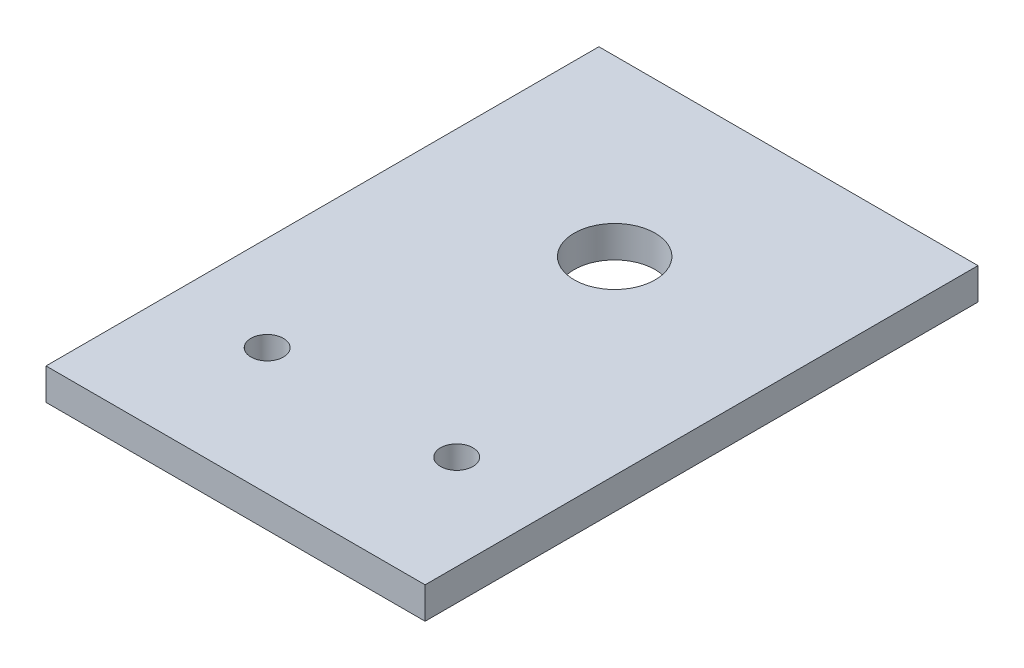
ISO-10303-21;
HEADER;
FILE_DESCRIPTION(('STEP AP214'),'2;1');
FILE_NAME('part.step','',(''),(''),'','','');
FILE_SCHEMA(('AUTOMOTIVE_DESIGN { 1 0 10303 214 1 1 1 1 }'));
ENDSEC;
DATA;
#1=APPLICATION_CONTEXT('core data for automotive mechanical design processes');
#2=APPLICATION_PROTOCOL_DEFINITION('international standard','automotive_design',2000,#1);
#3=PRODUCT_CONTEXT('',#1,'mechanical');
#4=PRODUCT('Part','Part','',(#3));
#5=PRODUCT_RELATED_PRODUCT_CATEGORY('part','',(#4));
#6=PRODUCT_DEFINITION_FORMATION('','',#4);
#7=PRODUCT_DEFINITION_CONTEXT('part definition',#1,'design');
#8=PRODUCT_DEFINITION('design','',#6,#7);
#9=PRODUCT_DEFINITION_SHAPE('','',#8);
#10=(LENGTH_UNIT() NAMED_UNIT(*) SI_UNIT(.MILLI.,.METRE.));
#11=(NAMED_UNIT(*) PLANE_ANGLE_UNIT() SI_UNIT($,.RADIAN.));
#12=(NAMED_UNIT(*) SI_UNIT($,.STERADIAN.) SOLID_ANGLE_UNIT());
#13=UNCERTAINTY_MEASURE_WITH_UNIT(LENGTH_MEASURE(1.E-05),#10,'distance_accuracy_value','');
#14=(GEOMETRIC_REPRESENTATION_CONTEXT(3) GLOBAL_UNCERTAINTY_ASSIGNED_CONTEXT((#13)) GLOBAL_UNIT_ASSIGNED_CONTEXT((#10,
#11,#12)) REPRESENTATION_CONTEXT('',''));
#15=CARTESIAN_POINT('',(0.,0.,0.));
#16=DIRECTION('',(0.,0.,1.));
#17=DIRECTION('',(1.,0.,0.));
#18=AXIS2_PLACEMENT_3D('',#15,#16,#17);
#19=CARTESIAN_POINT('',(38.1,6.35,55.5625));
#20=DIRECTION('',(-1.,0.,0.));
#21=DIRECTION('',(0.,0.,1.));
#22=AXIS2_PLACEMENT_3D('',#19,#20,#21);
#23=PLANE('',#22);
#24=DIRECTION('',(0.,0.,-1.));
#25=VECTOR('',#24,1.);
#26=CARTESIAN_POINT('',(38.1,0.,55.5625));
#27=LINE('',#26,#25);
#28=CARTESIAN_POINT('',(38.1,0.,55.5625));
#29=VERTEX_POINT('',#28);
#30=CARTESIAN_POINT('',(38.1,0.,-55.5625));
#31=VERTEX_POINT('',#30);
#32=EDGE_CURVE('E95',#29,#31,#27,.T.);
#33=ORIENTED_EDGE('',*,*,#32,.T.);
#34=DIRECTION('',(0.,-1.,0.));
#35=VECTOR('',#34,1.);
#36=CARTESIAN_POINT('',(38.1,6.35,-55.5625));
#37=LINE('',#36,#35);
#38=CARTESIAN_POINT('',(38.1,6.35,-55.5625));
#39=VERTEX_POINT('',#38);
#40=EDGE_CURVE('E11',#39,#31,#37,.T.);
#41=ORIENTED_EDGE('',*,*,#40,.F.);
#42=DIRECTION('',(0.,0.,-1.));
#43=VECTOR('',#42,1.);
#44=CARTESIAN_POINT('',(38.1,6.35,55.5625));
#45=LINE('',#44,#43);
#46=CARTESIAN_POINT('',(38.1,6.35,55.5625));
#47=VERTEX_POINT('',#46);
#48=EDGE_CURVE('E83',#47,#39,#45,.T.);
#49=ORIENTED_EDGE('',*,*,#48,.F.);
#50=DIRECTION('',(0.,-1.,0.));
#51=VECTOR('',#50,1.);
#52=CARTESIAN_POINT('',(38.1,6.35,55.5625));
#53=LINE('',#52,#51);
#54=EDGE_CURVE('E91',#47,#29,#53,.T.);
#55=ORIENTED_EDGE('',*,*,#54,.T.);
#56=EDGE_LOOP('',(#33,#41,#49,#55));
#57=FACE_BOUND('',#56,.T.);
#58=ADVANCED_FACE('F32',(#57),#23,.F.);
#59=CARTESIAN_POINT('',(-38.1,6.35,-55.5625));
#60=DIRECTION('',(0.,0.,1.));
#61=DIRECTION('',(1.,0.,0.));
#62=AXIS2_PLACEMENT_3D('',#59,#60,#61);
#63=PLANE('',#62);
#64=DIRECTION('',(-1.,0.,0.));
#65=VECTOR('',#64,1.);
#66=CARTESIAN_POINT('',(-38.1,0.,-55.5625));
#67=LINE('',#66,#65);
#68=CARTESIAN_POINT('',(-38.1,0.,-55.5625));
#69=VERTEX_POINT('',#68);
#70=EDGE_CURVE('E87',#31,#69,#67,.T.);
#71=ORIENTED_EDGE('',*,*,#70,.T.);
#72=DIRECTION('',(0.,-1.,0.));
#73=VECTOR('',#72,1.);
#74=CARTESIAN_POINT('',(-38.1,6.35,-55.5625));
#75=LINE('',#74,#73);
#76=CARTESIAN_POINT('',(-38.1,6.35,-55.5625));
#77=VERTEX_POINT('',#76);
#78=EDGE_CURVE('E40',#77,#69,#75,.T.);
#79=ORIENTED_EDGE('',*,*,#78,.F.);
#80=DIRECTION('',(-1.,0.,0.));
#81=VECTOR('',#80,1.);
#82=CARTESIAN_POINT('',(-38.1,6.35,-55.5625));
#83=LINE('',#82,#81);
#84=EDGE_CURVE('E78',#39,#77,#83,.T.);
#85=ORIENTED_EDGE('',*,*,#84,.F.);
#86=ORIENTED_EDGE('',*,*,#40,.T.);
#87=EDGE_LOOP('',(#71,#79,#85,#86));
#88=FACE_BOUND('',#87,.T.);
#89=ADVANCED_FACE('F86',(#88),#63,.F.);
#90=CARTESIAN_POINT('',(-38.1,6.35,55.5625));
#91=DIRECTION('',(1.,0.,0.));
#92=DIRECTION('',(0.,0.,-1.));
#93=AXIS2_PLACEMENT_3D('',#90,#91,#92);
#94=PLANE('',#93);
#95=DIRECTION('',(0.,0.,1.));
#96=VECTOR('',#95,1.);
#97=CARTESIAN_POINT('',(-38.1,0.,55.5625));
#98=LINE('',#97,#96);
#99=CARTESIAN_POINT('',(-38.1,0.,55.5625));
#100=VERTEX_POINT('',#99);
#101=EDGE_CURVE('E65',#69,#100,#98,.T.);
#102=ORIENTED_EDGE('',*,*,#101,.T.);
#103=DIRECTION('',(0.,-1.,0.));
#104=VECTOR('',#103,1.);
#105=CARTESIAN_POINT('',(-38.1,6.35,55.5625));
#106=LINE('',#105,#104);
#107=CARTESIAN_POINT('',(-38.1,6.35,55.5625));
#108=VERTEX_POINT('',#107);
#109=EDGE_CURVE('E88',#108,#100,#106,.T.);
#110=ORIENTED_EDGE('',*,*,#109,.F.);
#111=DIRECTION('',(0.,0.,1.));
#112=VECTOR('',#111,1.);
#113=CARTESIAN_POINT('',(-38.1,6.35,55.5625));
#114=LINE('',#113,#112);
#115=EDGE_CURVE('E81',#77,#108,#114,.T.);
#116=ORIENTED_EDGE('',*,*,#115,.F.);
#117=ORIENTED_EDGE('',*,*,#78,.T.);
#118=EDGE_LOOP('',(#102,#110,#116,#117));
#119=FACE_BOUND('',#118,.T.);
#120=ADVANCED_FACE('F89',(#119),#94,.F.);
#121=CARTESIAN_POINT('',(-38.1,6.35,55.5625));
#122=DIRECTION('',(0.,0.,-1.));
#123=DIRECTION('',(-1.,0.,0.));
#124=AXIS2_PLACEMENT_3D('',#121,#122,#123);
#125=PLANE('',#124);
#126=DIRECTION('',(1.,0.,0.));
#127=VECTOR('',#126,1.);
#128=CARTESIAN_POINT('',(-38.1,0.,55.5625));
#129=LINE('',#128,#127);
#130=EDGE_CURVE('E71',#100,#29,#129,.T.);
#131=ORIENTED_EDGE('',*,*,#130,.T.);
#132=ORIENTED_EDGE('',*,*,#54,.F.);
#133=DIRECTION('',(1.,0.,0.));
#134=VECTOR('',#133,1.);
#135=CARTESIAN_POINT('',(-38.1,6.35,55.5625));
#136=LINE('',#135,#134);
#137=EDGE_CURVE('E48',#108,#47,#136,.T.);
#138=ORIENTED_EDGE('',*,*,#137,.F.);
#139=ORIENTED_EDGE('',*,*,#109,.T.);
#140=EDGE_LOOP('',(#131,#132,#138,#139));
#141=FACE_BOUND('',#140,.T.);
#142=ADVANCED_FACE('F103',(#141),#125,.F.);
#143=CARTESIAN_POINT('',(0.,6.35,0.));
#144=DIRECTION('',(0.,-1.,0.));
#145=DIRECTION('',(0.,0.,-1.));
#146=AXIS2_PLACEMENT_3D('',#143,#144,#145);
#147=PLANE('',#146);
#148=CARTESIAN_POINT('',(-19.05,6.35,30.1625));
#149=DIRECTION('',(0.,-1.,0.));
#150=DIRECTION('',(0.,0.,1.));
#151=AXIS2_PLACEMENT_3D('',#148,#149,#150);
#152=CIRCLE('',#151,3.2639);
#153=CARTESIAN_POINT('',(-19.05,6.35,33.4264));
#154=VERTEX_POINT('',#153);
#155=EDGE_CURVE('E112',#154,#154,#152,.T.);
#156=ORIENTED_EDGE('',*,*,#155,.T.);
#157=EDGE_LOOP('',(#156));
#158=FACE_BOUND('',#157,.T.);
#159=CARTESIAN_POINT('',(0.,6.35,-20.6375));
#160=DIRECTION('',(0.,-1.,0.));
#161=DIRECTION('',(0.,0.,-1.));
#162=AXIS2_PLACEMENT_3D('',#159,#160,#161);
#163=CIRCLE('',#162,8.13562);
#164=CARTESIAN_POINT('',(0.,6.35,-28.77312));
#165=VERTEX_POINT('',#164);
#166=EDGE_CURVE('E118',#165,#165,#163,.T.);
#167=ORIENTED_EDGE('',*,*,#166,.T.);
#168=EDGE_LOOP('',(#167));
#169=FACE_BOUND('',#168,.T.);
#170=CARTESIAN_POINT('',(19.05,6.35,30.1625));
#171=DIRECTION('',(0.,-1.,0.));
#172=DIRECTION('',(0.,0.,-1.));
#173=AXIS2_PLACEMENT_3D('',#170,#171,#172);
#174=CIRCLE('',#173,3.2639);
#175=CARTESIAN_POINT('',(19.05,6.35,26.8986));
#176=VERTEX_POINT('',#175);
#177=EDGE_CURVE('E98',#176,#176,#174,.T.);
#178=ORIENTED_EDGE('',*,*,#177,.T.);
#179=EDGE_LOOP('',(#178));
#180=FACE_BOUND('',#179,.T.);
#181=ORIENTED_EDGE('',*,*,#48,.T.);
#182=ORIENTED_EDGE('',*,*,#84,.T.);
#183=ORIENTED_EDGE('',*,*,#115,.T.);
#184=ORIENTED_EDGE('',*,*,#137,.T.);
#185=EDGE_LOOP('',(#181,#182,#183,#184));
#186=FACE_BOUND('',#185,.T.);
#187=ADVANCED_FACE('F79',(#158,#169,#180,#186),#147,.F.);
#188=CARTESIAN_POINT('',(0.,0.,0.));
#189=DIRECTION('',(0.,-1.,0.));
#190=DIRECTION('',(0.,0.,-1.));
#191=AXIS2_PLACEMENT_3D('',#188,#189,#190);
#192=PLANE('',#191);
#193=CARTESIAN_POINT('',(-19.05,0.,30.1625));
#194=DIRECTION('',(0.,-1.,0.));
#195=DIRECTION('',(0.,0.,1.));
#196=AXIS2_PLACEMENT_3D('',#193,#194,#195);
#197=CIRCLE('',#196,3.2639);
#198=CARTESIAN_POINT('',(-19.05,0.,33.4264));
#199=VERTEX_POINT('',#198);
#200=EDGE_CURVE('E121',#199,#199,#197,.T.);
#201=ORIENTED_EDGE('',*,*,#200,.F.);
#202=EDGE_LOOP('',(#201));
#203=FACE_BOUND('',#202,.T.);
#204=CARTESIAN_POINT('',(0.,0.,-20.6375));
#205=DIRECTION('',(0.,-1.,0.));
#206=DIRECTION('',(0.,0.,-1.));
#207=AXIS2_PLACEMENT_3D('',#204,#205,#206);
#208=CIRCLE('',#207,8.13562);
#209=CARTESIAN_POINT('',(0.,0.,-28.77312));
#210=VERTEX_POINT('',#209);
#211=EDGE_CURVE('E115',#210,#210,#208,.T.);
#212=ORIENTED_EDGE('',*,*,#211,.F.);
#213=EDGE_LOOP('',(#212));
#214=FACE_BOUND('',#213,.T.);
#215=CARTESIAN_POINT('',(19.05,0.,30.1625));
#216=DIRECTION('',(0.,-1.,0.));
#217=DIRECTION('',(0.,0.,-1.));
#218=AXIS2_PLACEMENT_3D('',#215,#216,#217);
#219=CIRCLE('',#218,3.2639);
#220=CARTESIAN_POINT('',(19.05,0.,26.8986));
#221=VERTEX_POINT('',#220);
#222=EDGE_CURVE('E109',#221,#221,#219,.T.);
#223=ORIENTED_EDGE('',*,*,#222,.F.);
#224=EDGE_LOOP('',(#223));
#225=FACE_BOUND('',#224,.T.);
#226=ORIENTED_EDGE('',*,*,#32,.F.);
#227=ORIENTED_EDGE('',*,*,#130,.F.);
#228=ORIENTED_EDGE('',*,*,#101,.F.);
#229=ORIENTED_EDGE('',*,*,#70,.F.);
#230=EDGE_LOOP('',(#226,#227,#228,#229));
#231=FACE_BOUND('',#230,.T.);
#232=ADVANCED_FACE('F106',(#203,#214,#225,#231),#192,.T.);
#233=CARTESIAN_POINT('',(19.05,6.35,30.1625));
#234=DIRECTION('',(0.,-1.,0.));
#235=DIRECTION('',(0.,0.,-1.));
#236=AXIS2_PLACEMENT_3D('',#233,#234,#235);
#237=CYLINDRICAL_SURFACE('',#236,3.2639);
#238=ORIENTED_EDGE('',*,*,#177,.F.);
#239=EDGE_LOOP('',(#238));
#240=FACE_BOUND('',#239,.T.);
#241=ORIENTED_EDGE('',*,*,#222,.T.);
#242=EDGE_LOOP('',(#241));
#243=FACE_BOUND('',#242,.T.);
#244=ADVANCED_FACE('F138',(#240,#243),#237,.F.);
#245=CARTESIAN_POINT('',(0.,6.35,-20.6375));
#246=DIRECTION('',(0.,-1.,0.));
#247=DIRECTION('',(0.,0.,-1.));
#248=AXIS2_PLACEMENT_3D('',#245,#246,#247);
#249=CYLINDRICAL_SURFACE('',#248,8.13562);
#250=ORIENTED_EDGE('',*,*,#166,.F.);
#251=EDGE_LOOP('',(#250));
#252=FACE_BOUND('',#251,.T.);
#253=ORIENTED_EDGE('',*,*,#211,.T.);
#254=EDGE_LOOP('',(#253));
#255=FACE_BOUND('',#254,.T.);
#256=ADVANCED_FACE('F132',(#252,#255),#249,.F.);
#257=CARTESIAN_POINT('',(-19.05,6.35,30.1625));
#258=DIRECTION('',(0.,-1.,0.));
#259=DIRECTION('',(0.,0.,-1.));
#260=AXIS2_PLACEMENT_3D('',#257,#258,#259);
#261=CYLINDRICAL_SURFACE('',#260,3.2639);
#262=ORIENTED_EDGE('',*,*,#155,.F.);
#263=EDGE_LOOP('',(#262));
#264=FACE_BOUND('',#263,.T.);
#265=ORIENTED_EDGE('',*,*,#200,.T.);
#266=EDGE_LOOP('',(#265));
#267=FACE_BOUND('',#266,.T.);
#268=ADVANCED_FACE('F129',(#264,#267),#261,.F.);
#269=CLOSED_SHELL('',(#58,#89,#120,#142,#187,#232,#244,#256,#268));
#270=MANIFOLD_SOLID_BREP('B2',#269);
#271=ADVANCED_BREP_SHAPE_REPRESENTATION('',(#18,#270),#14);
#272=SHAPE_DEFINITION_REPRESENTATION(#9,#271);
ENDSEC;
END-ISO-10303-21;
